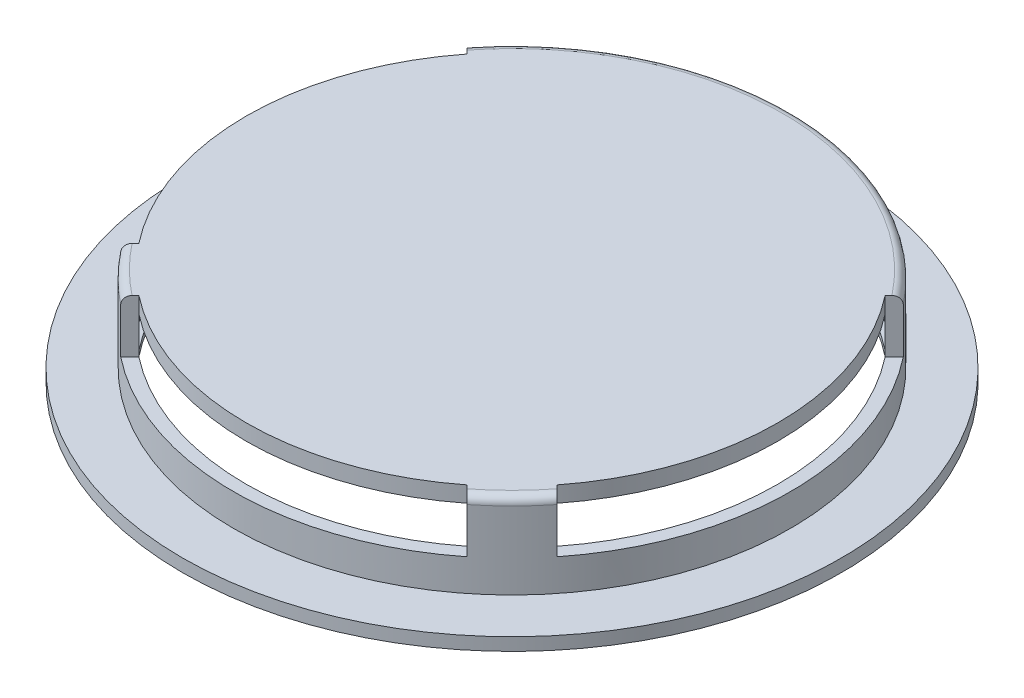
ISO-10303-21;
HEADER;
FILE_DESCRIPTION(('STEP AP214'),'2;1');
FILE_NAME('part.step','',(''),(''),'','','');
FILE_SCHEMA(('AUTOMOTIVE_DESIGN { 1 0 10303 214 1 1 1 1 }'));
ENDSEC;
DATA;
#1=APPLICATION_CONTEXT('core data for automotive mechanical design processes');
#2=APPLICATION_PROTOCOL_DEFINITION('international standard','automotive_design',2000,#1);
#3=PRODUCT_CONTEXT('',#1,'mechanical');
#4=PRODUCT('Part','Part','',(#3));
#5=PRODUCT_RELATED_PRODUCT_CATEGORY('part','',(#4));
#6=PRODUCT_DEFINITION_FORMATION('','',#4);
#7=PRODUCT_DEFINITION_CONTEXT('part definition',#1,'design');
#8=PRODUCT_DEFINITION('design','',#6,#7);
#9=PRODUCT_DEFINITION_SHAPE('','',#8);
#10=(LENGTH_UNIT() NAMED_UNIT(*) SI_UNIT(.MILLI.,.METRE.));
#11=(NAMED_UNIT(*) PLANE_ANGLE_UNIT() SI_UNIT($,.RADIAN.));
#12=(NAMED_UNIT(*) SI_UNIT($,.STERADIAN.) SOLID_ANGLE_UNIT());
#13=UNCERTAINTY_MEASURE_WITH_UNIT(LENGTH_MEASURE(1.E-05),#10,'distance_accuracy_value','');
#14=(GEOMETRIC_REPRESENTATION_CONTEXT(3) GLOBAL_UNCERTAINTY_ASSIGNED_CONTEXT((#13)) GLOBAL_UNIT_ASSIGNED_CONTEXT((#10,
#11,#12)) REPRESENTATION_CONTEXT('',''));
#15=CARTESIAN_POINT('',(0.,0.,0.));
#16=DIRECTION('',(0.,0.,1.));
#17=DIRECTION('',(1.,0.,0.));
#18=AXIS2_PLACEMENT_3D('',#15,#16,#17);
#19=CARTESIAN_POINT('',(0.,1.2,0.));
#20=DIRECTION('',(0.,-1.,0.));
#21=DIRECTION('',(0.,0.,-1.));
#22=AXIS2_PLACEMENT_3D('',#19,#20,#21);
#23=CYLINDRICAL_SURFACE('',#22,25.);
#24=DIRECTION('',(0.,1.,0.));
#25=VECTOR('',#24,1.);
#26=CARTESIAN_POINT('',(-19.6712491183439,4.2,-15.4286084312246));
#27=LINE('',#26,#25);
#28=CARTESIAN_POINT('',(-19.6712491183439,4.2,-15.4286084312246));
#29=VERTEX_POINT('',#28);
#30=CARTESIAN_POINT('',(-19.6712491183439,7.7,-15.4286084312246));
#31=VERTEX_POINT('',#30);
#32=EDGE_CURVE('E666',#29,#31,#27,.T.);
#33=ORIENTED_EDGE('',*,*,#32,.F.);
#34=CARTESIAN_POINT('',(0.,4.2,0.));
#35=DIRECTION('',(0.,-1.,0.));
#36=DIRECTION('',(0.,0.,1.));
#37=AXIS2_PLACEMENT_3D('',#34,#35,#36);
#38=CIRCLE('',#37,25.);
#39=CARTESIAN_POINT('',(-19.6712491183439,4.2,15.4286084312246));
#40=VERTEX_POINT('',#39);
#41=EDGE_CURVE('E176',#40,#29,#38,.T.);
#42=ORIENTED_EDGE('',*,*,#41,.F.);
#43=DIRECTION('',(0.,1.,0.));
#44=VECTOR('',#43,1.);
#45=CARTESIAN_POINT('',(-19.6712491183439,4.2,15.4286084312246));
#46=LINE('',#45,#44);
#47=CARTESIAN_POINT('',(-19.6712491183439,7.7,15.4286084312246));
#48=VERTEX_POINT('',#47);
#49=EDGE_CURVE('E173',#40,#48,#46,.T.);
#50=ORIENTED_EDGE('',*,*,#49,.T.);
#51=CARTESIAN_POINT('',(0.,7.7,0.));
#52=DIRECTION('',(0.,1.,0.));
#53=DIRECTION('',(0.,0.,1.));
#54=AXIS2_PLACEMENT_3D('',#51,#52,#53);
#55=CIRCLE('',#54,25.);
#56=CARTESIAN_POINT('',(-15.4286084312246,7.7,19.6712491183439));
#57=VERTEX_POINT('',#56);
#58=EDGE_CURVE('E269',#48,#57,#55,.T.);
#59=ORIENTED_EDGE('',*,*,#58,.T.);
#60=DIRECTION('',(0.,1.,0.));
#61=VECTOR('',#60,1.);
#62=CARTESIAN_POINT('',(-15.4286084312246,4.2,19.6712491183439));
#63=LINE('',#62,#61);
#64=CARTESIAN_POINT('',(-15.4286084312246,4.2,19.6712491183439));
#65=VERTEX_POINT('',#64);
#66=EDGE_CURVE('E250',#65,#57,#63,.T.);
#67=ORIENTED_EDGE('',*,*,#66,.F.);
#68=CARTESIAN_POINT('',(0.,4.2,0.));
#69=DIRECTION('',(0.,-1.,0.));
#70=DIRECTION('',(0.,0.,1.));
#71=AXIS2_PLACEMENT_3D('',#68,#69,#70);
#72=CIRCLE('',#71,25.);
#73=CARTESIAN_POINT('',(15.4286084312246,4.2,19.6712491183439));
#74=VERTEX_POINT('',#73);
#75=EDGE_CURVE('E236',#74,#65,#72,.T.);
#76=ORIENTED_EDGE('',*,*,#75,.F.);
#77=DIRECTION('',(0.,1.,0.));
#78=VECTOR('',#77,1.);
#79=CARTESIAN_POINT('',(15.4286084312246,4.2,19.6712491183439));
#80=LINE('',#79,#78);
#81=CARTESIAN_POINT('',(15.4286084312246,7.7,19.6712491183439));
#82=VERTEX_POINT('',#81);
#83=EDGE_CURVE('E253',#74,#82,#80,.T.);
#84=ORIENTED_EDGE('',*,*,#83,.T.);
#85=CARTESIAN_POINT('',(19.6712491183439,7.7,15.4286084312246));
#86=VERTEX_POINT('',#85);
#87=EDGE_CURVE('E270',#82,#86,#55,.T.);
#88=ORIENTED_EDGE('',*,*,#87,.T.);
#89=DIRECTION('',(0.,1.,0.));
#90=VECTOR('',#89,1.);
#91=CARTESIAN_POINT('',(19.6712491183439,4.2,15.4286084312246));
#92=LINE('',#91,#90);
#93=CARTESIAN_POINT('',(19.6712491183439,4.2,15.4286084312246));
#94=VERTEX_POINT('',#93);
#95=EDGE_CURVE('E220',#94,#86,#92,.T.);
#96=ORIENTED_EDGE('',*,*,#95,.F.);
#97=CARTESIAN_POINT('',(0.,4.2,0.));
#98=DIRECTION('',(0.,-1.,0.));
#99=DIRECTION('',(0.,0.,1.));
#100=AXIS2_PLACEMENT_3D('',#97,#98,#99);
#101=CIRCLE('',#100,25.);
#102=CARTESIAN_POINT('',(19.6712491183439,4.2,-15.4286084312246));
#103=VERTEX_POINT('',#102);
#104=EDGE_CURVE('E203',#103,#94,#101,.T.);
#105=ORIENTED_EDGE('',*,*,#104,.F.);
#106=DIRECTION('',(0.,1.,0.));
#107=VECTOR('',#106,1.);
#108=CARTESIAN_POINT('',(19.6712491183439,4.2,-15.4286084312246));
#109=LINE('',#108,#107);
#110=CARTESIAN_POINT('',(19.6712491183439,7.7,-15.4286084312246));
#111=VERTEX_POINT('',#110);
#112=EDGE_CURVE('E223',#103,#111,#109,.T.);
#113=ORIENTED_EDGE('',*,*,#112,.T.);
#114=EDGE_CURVE('E274',#111,#31,#55,.T.);
#115=ORIENTED_EDGE('',*,*,#114,.T.);
#116=EDGE_LOOP('',(#33,#42,#50,#59,#67,#76,#84,#88,#96,#105,#113,#115));
#117=FACE_BOUND('',#116,.T.);
#118=CARTESIAN_POINT('',(0.,3.5,0.));
#119=DIRECTION('',(0.,-1.,0.));
#120=DIRECTION('',(0.,0.,-1.));
#121=AXIS2_PLACEMENT_3D('',#118,#119,#120);
#122=CIRCLE('',#121,25.);
#123=CARTESIAN_POINT('',(0.,3.5,-25.));
#124=VERTEX_POINT('',#123);
#125=EDGE_CURVE('E697',#124,#124,#122,.T.);
#126=ORIENTED_EDGE('',*,*,#125,.T.);
#127=EDGE_LOOP('',(#126));
#128=FACE_BOUND('',#127,.T.);
#129=ADVANCED_FACE('F40',(#117,#128),#23,.F.);
#130=CARTESIAN_POINT('',(0.,1.2,0.));
#131=DIRECTION('',(0.,1.,0.));
#132=DIRECTION('',(0.,0.,1.));
#133=AXIS2_PLACEMENT_3D('',#130,#131,#132);
#134=PLANE('',#133);
#135=CARTESIAN_POINT('',(0.,1.2,0.));
#136=DIRECTION('',(0.,1.,0.));
#137=DIRECTION('',(0.,0.,1.));
#138=AXIS2_PLACEMENT_3D('',#135,#136,#137);
#139=CIRCLE('',#138,31.);
#140=CARTESIAN_POINT('',(0.,1.2,31.));
#141=VERTEX_POINT('',#140);
#142=EDGE_CURVE('E281',#141,#141,#139,.T.);
#143=ORIENTED_EDGE('',*,*,#142,.T.);
#144=EDGE_LOOP('',(#143));
#145=FACE_BOUND('',#144,.T.);
#146=CARTESIAN_POINT('',(0.,1.2,0.));
#147=DIRECTION('',(0.,1.,0.));
#148=DIRECTION('',(0.,0.,1.));
#149=AXIS2_PLACEMENT_3D('',#146,#147,#148);
#150=CIRCLE('',#149,26.2);
#151=CARTESIAN_POINT('',(0.,1.2,26.2));
#152=VERTEX_POINT('',#151);
#153=EDGE_CURVE('E273',#152,#152,#150,.T.);
#154=ORIENTED_EDGE('',*,*,#153,.F.);
#155=EDGE_LOOP('',(#154));
#156=FACE_BOUND('',#155,.T.);
#157=ADVANCED_FACE('F362',(#145,#156),#134,.T.);
#158=CARTESIAN_POINT('',(0.,0.,0.));
#159=DIRECTION('',(0.,1.,0.));
#160=DIRECTION('',(0.,0.,1.));
#161=AXIS2_PLACEMENT_3D('',#158,#159,#160);
#162=PLANE('',#161);
#163=CARTESIAN_POINT('',(0.,0.,0.));
#164=DIRECTION('',(0.,1.,0.));
#165=DIRECTION('',(0.,0.,1.));
#166=AXIS2_PLACEMENT_3D('',#163,#164,#165);
#167=CIRCLE('',#166,31.);
#168=CARTESIAN_POINT('',(0.,0.,31.));
#169=VERTEX_POINT('',#168);
#170=EDGE_CURVE('E280',#169,#169,#167,.T.);
#171=ORIENTED_EDGE('',*,*,#170,.F.);
#172=EDGE_LOOP('',(#171));
#173=FACE_BOUND('',#172,.T.);
#174=CARTESIAN_POINT('',(0.,0.,0.));
#175=DIRECTION('',(0.,1.,0.));
#176=DIRECTION('',(0.,0.,1.));
#177=AXIS2_PLACEMENT_3D('',#174,#175,#176);
#178=CIRCLE('',#177,25.);
#179=CARTESIAN_POINT('',(0.,0.,25.));
#180=VERTEX_POINT('',#179);
#181=EDGE_CURVE('E277',#180,#180,#178,.T.);
#182=ORIENTED_EDGE('',*,*,#181,.T.);
#183=EDGE_LOOP('',(#182));
#184=FACE_BOUND('',#183,.T.);
#185=ADVANCED_FACE('F369',(#173,#184),#162,.F.);
#186=CARTESIAN_POINT('',(0.,1.2,0.));
#187=DIRECTION('',(0.,-1.,0.));
#188=DIRECTION('',(0.,0.,-1.));
#189=AXIS2_PLACEMENT_3D('',#186,#187,#188);
#190=CYLINDRICAL_SURFACE('',#189,31.);
#191=ORIENTED_EDGE('',*,*,#142,.F.);
#192=EDGE_LOOP('',(#191));
#193=FACE_BOUND('',#192,.T.);
#194=ORIENTED_EDGE('',*,*,#170,.T.);
#195=EDGE_LOOP('',(#194));
#196=FACE_BOUND('',#195,.T.);
#197=ADVANCED_FACE('F376',(#193,#196),#190,.T.);
#198=CARTESIAN_POINT('',(0.,0.5,0.));
#199=DIRECTION('',(0.,-1.,0.));
#200=DIRECTION('',(0.,0.,-1.));
#201=AXIS2_PLACEMENT_3D('',#198,#199,#200);
#202=CIRCLE('',#201,25.);
#203=CARTESIAN_POINT('',(0.,0.5,-25.));
#204=VERTEX_POINT('',#203);
#205=EDGE_CURVE('E388',#204,#204,#202,.T.);
#206=ORIENTED_EDGE('',*,*,#205,.F.);
#207=EDGE_LOOP('',(#206));
#208=FACE_BOUND('',#207,.T.);
#209=ORIENTED_EDGE('',*,*,#181,.F.);
#210=EDGE_LOOP('',(#209));
#211=FACE_BOUND('',#210,.T.);
#212=ADVANCED_FACE('F365',(#208,#211),#23,.F.);
#213=CARTESIAN_POINT('',(0.,7.7,0.));
#214=DIRECTION('',(0.,-1.,0.));
#215=DIRECTION('',(0.,0.,-1.));
#216=AXIS2_PLACEMENT_3D('',#213,#214,#215);
#217=CYLINDRICAL_SURFACE('',#216,26.2);
#218=ORIENTED_EDGE('',*,*,#153,.T.);
#219=EDGE_LOOP('',(#218));
#220=FACE_BOUND('',#219,.T.);
#221=DIRECTION('',(0.,1.,0.));
#222=VECTOR('',#221,1.);
#223=CARTESIAN_POINT('',(20.5256676560834,4.2,16.2830269689641));
#224=LINE('',#223,#222);
#225=CARTESIAN_POINT('',(20.5256676560834,4.2,16.2830269689641));
#226=VERTEX_POINT('',#225);
#227=CARTESIAN_POINT('',(20.5256676560834,8.45,16.2830269689641));
#228=VERTEX_POINT('',#227);
#229=EDGE_CURVE('E217',#226,#228,#224,.T.);
#230=ORIENTED_EDGE('',*,*,#229,.T.);
#231=CARTESIAN_POINT('',(0.,8.45,0.));
#232=DIRECTION('',(0.,1.,0.));
#233=DIRECTION('',(0.,0.,1.));
#234=AXIS2_PLACEMENT_3D('',#231,#232,#233);
#235=CIRCLE('',#234,26.2);
#236=CARTESIAN_POINT('',(16.2830269689642,8.45,20.5256676560834));
#237=VERTEX_POINT('',#236);
#238=EDGE_CURVE('E636',#228,#237,#235,.F.);
#239=ORIENTED_EDGE('',*,*,#238,.T.);
#240=DIRECTION('',(0.,1.,0.));
#241=VECTOR('',#240,1.);
#242=CARTESIAN_POINT('',(16.2830269689642,4.2,20.5256676560834));
#243=LINE('',#242,#241);
#244=CARTESIAN_POINT('',(16.2830269689642,4.2,20.5256676560834));
#245=VERTEX_POINT('',#244);
#246=EDGE_CURVE('E241',#245,#237,#243,.T.);
#247=ORIENTED_EDGE('',*,*,#246,.F.);
#248=CARTESIAN_POINT('',(0.,4.2,0.));
#249=DIRECTION('',(0.,1.,0.));
#250=DIRECTION('',(0.,0.,1.));
#251=AXIS2_PLACEMENT_3D('',#248,#249,#250);
#252=CIRCLE('',#251,26.2);
#253=CARTESIAN_POINT('',(-16.2830269689641,4.2,20.5256676560834));
#254=VERTEX_POINT('',#253);
#255=EDGE_CURVE('E229',#254,#245,#252,.T.);
#256=ORIENTED_EDGE('',*,*,#255,.F.);
#257=DIRECTION('',(0.,1.,0.));
#258=VECTOR('',#257,1.);
#259=CARTESIAN_POINT('',(-16.2830269689641,4.2,20.5256676560834));
#260=LINE('',#259,#258);
#261=CARTESIAN_POINT('',(-16.2830269689641,8.45,20.5256676560834));
#262=VERTEX_POINT('',#261);
#263=EDGE_CURVE('E212',#254,#262,#260,.T.);
#264=ORIENTED_EDGE('',*,*,#263,.T.);
#265=CARTESIAN_POINT('',(0.,8.45,0.));
#266=DIRECTION('',(0.,1.,0.));
#267=DIRECTION('',(0.,0.,1.));
#268=AXIS2_PLACEMENT_3D('',#265,#266,#267);
#269=CIRCLE('',#268,26.2);
#270=CARTESIAN_POINT('',(-20.5256676560834,8.45,16.2830269689641));
#271=VERTEX_POINT('',#270);
#272=EDGE_CURVE('E56',#262,#271,#269,.F.);
#273=ORIENTED_EDGE('',*,*,#272,.T.);
#274=DIRECTION('',(0.,1.,0.));
#275=VECTOR('',#274,1.);
#276=CARTESIAN_POINT('',(-20.5256676560834,4.2,16.2830269689641));
#277=LINE('',#276,#275);
#278=CARTESIAN_POINT('',(-20.5256676560834,4.2,16.2830269689641));
#279=VERTEX_POINT('',#278);
#280=EDGE_CURVE('E169',#279,#271,#277,.T.);
#281=ORIENTED_EDGE('',*,*,#280,.F.);
#282=CARTESIAN_POINT('',(0.,4.2,0.));
#283=DIRECTION('',(0.,1.,0.));
#284=DIRECTION('',(0.,0.,1.));
#285=AXIS2_PLACEMENT_3D('',#282,#283,#284);
#286=CIRCLE('',#285,26.2);
#287=CARTESIAN_POINT('',(-20.5256676560834,4.2,-16.2830269689641));
#288=VERTEX_POINT('',#287);
#289=EDGE_CURVE('E177',#288,#279,#286,.T.);
#290=ORIENTED_EDGE('',*,*,#289,.F.);
#291=DIRECTION('',(0.,1.,0.));
#292=VECTOR('',#291,1.);
#293=CARTESIAN_POINT('',(-20.5256676560834,4.2,-16.2830269689641));
#294=LINE('',#293,#292);
#295=CARTESIAN_POINT('',(-20.5256676560834,8.45,-16.2830269689641));
#296=VERTEX_POINT('',#295);
#297=EDGE_CURVE('E263',#288,#296,#294,.T.);
#298=ORIENTED_EDGE('',*,*,#297,.T.);
#299=CARTESIAN_POINT('',(0.,8.45,0.));
#300=DIRECTION('',(0.,1.,0.));
#301=DIRECTION('',(0.,0.,1.));
#302=AXIS2_PLACEMENT_3D('',#299,#300,#301);
#303=CIRCLE('',#302,26.2);
#304=CARTESIAN_POINT('',(20.5256676560834,8.45,-16.2830269689641));
#305=VERTEX_POINT('',#304);
#306=EDGE_CURVE('E303',#296,#305,#303,.F.);
#307=ORIENTED_EDGE('',*,*,#306,.T.);
#308=DIRECTION('',(0.,1.,0.));
#309=VECTOR('',#308,1.);
#310=CARTESIAN_POINT('',(20.5256676560834,4.2,-16.2830269689641));
#311=LINE('',#310,#309);
#312=CARTESIAN_POINT('',(20.5256676560834,4.2,-16.2830269689641));
#313=VERTEX_POINT('',#312);
#314=EDGE_CURVE('E208',#313,#305,#311,.T.);
#315=ORIENTED_EDGE('',*,*,#314,.F.);
#316=CARTESIAN_POINT('',(0.,4.2,0.));
#317=DIRECTION('',(0.,1.,0.));
#318=DIRECTION('',(0.,0.,1.));
#319=AXIS2_PLACEMENT_3D('',#316,#317,#318);
#320=CIRCLE('',#319,26.2);
#321=EDGE_CURVE('E196',#226,#313,#320,.T.);
#322=ORIENTED_EDGE('',*,*,#321,.F.);
#323=EDGE_LOOP('',(#230,#239,#247,#256,#264,#273,#281,#290,#298,#307,#315,#322));
#324=FACE_BOUND('',#323,.T.);
#325=ADVANCED_FACE('F188',(#220,#324),#217,.T.);
#326=CARTESIAN_POINT('',(0.,7.7,0.));
#327=DIRECTION('',(0.,1.,0.));
#328=DIRECTION('',(0.,0.,1.));
#329=AXIS2_PLACEMENT_3D('',#326,#327,#328);
#330=PLANE('',#329);
#331=CARTESIAN_POINT('',(0.,7.7,0.));
#332=DIRECTION('',(0.,1.,0.));
#333=DIRECTION('',(0.,0.,1.));
#334=AXIS2_PLACEMENT_3D('',#331,#332,#333);
#335=CIRCLE('',#334,3.5);
#336=CARTESIAN_POINT('',(0.,7.7,3.5));
#337=VERTEX_POINT('',#336);
#338=EDGE_CURVE('E11',#337,#337,#335,.F.);
#339=ORIENTED_EDGE('',*,*,#338,.F.);
#340=EDGE_LOOP('',(#339));
#341=FACE_BOUND('',#340,.T.);
#342=ORIENTED_EDGE('',*,*,#87,.F.);
#343=CARTESIAN_POINT('',(0.,7.7,0.));
#344=DIRECTION('',(0.,1.,0.));
#345=DIRECTION('',(0.,0.,1.));
#346=AXIS2_PLACEMENT_3D('',#343,#344,#345);
#347=CIRCLE('',#346,25.);
#348=EDGE_CURVE('E259',#82,#57,#347,.F.);
#349=ORIENTED_EDGE('',*,*,#348,.T.);
#350=ORIENTED_EDGE('',*,*,#58,.F.);
#351=CARTESIAN_POINT('',(0.,7.7,0.));
#352=DIRECTION('',(0.,1.,0.));
#353=DIRECTION('',(0.,0.,1.));
#354=AXIS2_PLACEMENT_3D('',#351,#352,#353);
#355=CIRCLE('',#354,25.);
#356=EDGE_CURVE('E266',#48,#31,#355,.F.);
#357=ORIENTED_EDGE('',*,*,#356,.T.);
#358=ORIENTED_EDGE('',*,*,#114,.F.);
#359=CARTESIAN_POINT('',(0.,7.7,0.));
#360=DIRECTION('',(0.,1.,0.));
#361=DIRECTION('',(0.,0.,1.));
#362=AXIS2_PLACEMENT_3D('',#359,#360,#361);
#363=CIRCLE('',#362,25.);
#364=EDGE_CURVE('E262',#111,#86,#363,.F.);
#365=ORIENTED_EDGE('',*,*,#364,.T.);
#366=EDGE_LOOP('',(#342,#349,#350,#357,#358,#365));
#367=FACE_BOUND('',#366,.T.);
#368=ADVANCED_FACE('F382',(#341,#367),#330,.F.);
#369=CARTESIAN_POINT('',(0.,9.2,0.));
#370=DIRECTION('',(0.,1.,0.));
#371=DIRECTION('',(0.,0.,1.));
#372=AXIS2_PLACEMENT_3D('',#369,#370,#371);
#373=PLANE('',#372);
#374=DIRECTION('',(-0.707106781186549,0.,-0.707106781186546));
#375=VECTOR('',#374,1.);
#376=CARTESIAN_POINT('',(16.2830269689642,9.2,20.5256676560834));
#377=LINE('',#376,#375);
#378=CARTESIAN_POINT('',(15.749081162842,9.2,19.9917218499612));
#379=VERTEX_POINT('',#378);
#380=CARTESIAN_POINT('',(15.4286084312246,9.2,19.6712491183439));
#381=VERTEX_POINT('',#380);
#382=EDGE_CURVE('E242',#379,#381,#377,.T.);
#383=ORIENTED_EDGE('',*,*,#382,.F.);
#384=CARTESIAN_POINT('',(0.,9.2,0.));
#385=DIRECTION('',(0.,1.,0.));
#386=DIRECTION('',(0.,0.,1.));
#387=AXIS2_PLACEMENT_3D('',#384,#385,#386);
#388=CIRCLE('',#387,25.45);
#389=CARTESIAN_POINT('',(19.9917218499613,9.2,15.7490811628419));
#390=VERTEX_POINT('',#389);
#391=EDGE_CURVE('E292',#379,#390,#388,.T.);
#392=ORIENTED_EDGE('',*,*,#391,.T.);
#393=DIRECTION('',(0.707106781186548,0.,0.707106781186547));
#394=VECTOR('',#393,1.);
#395=CARTESIAN_POINT('',(20.5256676560834,9.2,16.2830269689641));
#396=LINE('',#395,#394);
#397=CARTESIAN_POINT('',(19.6712491183439,9.2,15.4286084312246));
#398=VERTEX_POINT('',#397);
#399=EDGE_CURVE('E200',#398,#390,#396,.T.);
#400=ORIENTED_EDGE('',*,*,#399,.F.);
#401=CARTESIAN_POINT('',(0.,9.2,0.));
#402=DIRECTION('',(0.,-1.,0.));
#403=DIRECTION('',(0.,0.,1.));
#404=AXIS2_PLACEMENT_3D('',#401,#402,#403);
#405=CIRCLE('',#404,25.);
#406=CARTESIAN_POINT('',(19.6712491183439,9.2,-15.4286084312246));
#407=VERTEX_POINT('',#406);
#408=EDGE_CURVE('E211',#407,#398,#405,.T.);
#409=ORIENTED_EDGE('',*,*,#408,.F.);
#410=DIRECTION('',(-0.707106781186549,0.,0.707106781186546));
#411=VECTOR('',#410,1.);
#412=CARTESIAN_POINT('',(20.5256676560834,9.2,-16.2830269689641));
#413=LINE('',#412,#411);
#414=CARTESIAN_POINT('',(19.9917218499613,9.2,-15.7490811628419));
#415=VERTEX_POINT('',#414);
#416=EDGE_CURVE('E209',#415,#407,#413,.T.);
#417=ORIENTED_EDGE('',*,*,#416,.F.);
#418=CARTESIAN_POINT('',(0.,9.2,0.));
#419=DIRECTION('',(0.,1.,0.));
#420=DIRECTION('',(0.,0.,1.));
#421=AXIS2_PLACEMENT_3D('',#418,#419,#420);
#422=CIRCLE('',#421,25.45);
#423=CARTESIAN_POINT('',(-19.9917218499613,9.2,-15.7490811628419));
#424=VERTEX_POINT('',#423);
#425=EDGE_CURVE('E284',#415,#424,#422,.T.);
#426=ORIENTED_EDGE('',*,*,#425,.T.);
#427=DIRECTION('',(-0.707106781186549,0.,-0.707106781186546));
#428=VECTOR('',#427,1.);
#429=CARTESIAN_POINT('',(-19.6712491183439,9.2,-15.4286084312246));
#430=LINE('',#429,#428);
#431=CARTESIAN_POINT('',(-19.6712491183439,9.2,-15.4286084312246));
#432=VERTEX_POINT('',#431);
#433=EDGE_CURVE('E185',#432,#424,#430,.T.);
#434=ORIENTED_EDGE('',*,*,#433,.F.);
#435=CARTESIAN_POINT('',(0.,9.2,0.));
#436=DIRECTION('',(0.,-1.,0.));
#437=DIRECTION('',(0.,0.,1.));
#438=AXIS2_PLACEMENT_3D('',#435,#436,#437);
#439=CIRCLE('',#438,25.);
#440=CARTESIAN_POINT('',(-19.6712491183439,9.2,15.4286084312246));
#441=VERTEX_POINT('',#440);
#442=EDGE_CURVE('E651',#441,#432,#439,.T.);
#443=ORIENTED_EDGE('',*,*,#442,.F.);
#444=DIRECTION('',(0.707106781186548,0.,-0.707106781186548));
#445=VECTOR('',#444,1.);
#446=CARTESIAN_POINT('',(-19.6712491183439,9.2,15.4286084312246));
#447=LINE('',#446,#445);
#448=CARTESIAN_POINT('',(-19.9917218499612,9.2,15.7490811628419));
#449=VERTEX_POINT('',#448);
#450=EDGE_CURVE('E219',#449,#441,#447,.T.);
#451=ORIENTED_EDGE('',*,*,#450,.F.);
#452=CARTESIAN_POINT('',(0.,9.2,0.));
#453=DIRECTION('',(0.,1.,0.));
#454=DIRECTION('',(0.,0.,1.));
#455=AXIS2_PLACEMENT_3D('',#452,#453,#454);
#456=CIRCLE('',#455,25.45);
#457=CARTESIAN_POINT('',(-15.749081162842,9.2,19.9917218499612));
#458=VERTEX_POINT('',#457);
#459=EDGE_CURVE('E289',#449,#458,#456,.T.);
#460=ORIENTED_EDGE('',*,*,#459,.T.);
#461=DIRECTION('',(-0.707106781186549,0.,0.707106781186546));
#462=VECTOR('',#461,1.);
#463=CARTESIAN_POINT('',(-15.4286084312246,9.2,19.6712491183439));
#464=LINE('',#463,#462);
#465=CARTESIAN_POINT('',(-15.4286084312246,9.2,19.6712491183439));
#466=VERTEX_POINT('',#465);
#467=EDGE_CURVE('E233',#466,#458,#464,.T.);
#468=ORIENTED_EDGE('',*,*,#467,.F.);
#469=CARTESIAN_POINT('',(0.,9.2,0.));
#470=DIRECTION('',(0.,-1.,0.));
#471=DIRECTION('',(0.,0.,1.));
#472=AXIS2_PLACEMENT_3D('',#469,#470,#471);
#473=CIRCLE('',#472,25.);
#474=EDGE_CURVE('E244',#381,#466,#473,.T.);
#475=ORIENTED_EDGE('',*,*,#474,.F.);
#476=EDGE_LOOP('',(#383,#392,#400,#409,#417,#426,#434,#443,#451,#460,#468,#475));
#477=FACE_BOUND('',#476,.T.);
#478=ADVANCED_FACE('F421',(#477),#373,.T.);
#479=CARTESIAN_POINT('',(0.,4.2,0.));
#480=DIRECTION('',(0.,1.,0.));
#481=DIRECTION('',(0.,0.,1.));
#482=AXIS2_PLACEMENT_3D('',#479,#480,#481);
#483=CYLINDRICAL_SURFACE('',#482,25.);
#484=EDGE_CURVE('E256',#82,#381,#80,.T.);
#485=ORIENTED_EDGE('',*,*,#484,.T.);
#486=ORIENTED_EDGE('',*,*,#474,.T.);
#487=EDGE_CURVE('E252',#57,#466,#63,.T.);
#488=ORIENTED_EDGE('',*,*,#487,.F.);
#489=ORIENTED_EDGE('',*,*,#348,.F.);
#490=EDGE_LOOP('',(#485,#486,#488,#489));
#491=FACE_BOUND('',#490,.T.);
#492=ADVANCED_FACE('F415',(#491),#483,.T.);
#493=CARTESIAN_POINT('',(-15.4286084312246,4.2,19.6712491183439));
#494=DIRECTION('',(-0.707106781186546,0.,-0.707106781186549));
#495=DIRECTION('',(-0.707106781186549,0.,0.707106781186546));
#496=AXIS2_PLACEMENT_3D('',#493,#494,#495);
#497=PLANE('',#496);
#498=ORIENTED_EDGE('',*,*,#467,.T.);
#499=CARTESIAN_POINT('',(-15.749081162842,9.2,19.9917218499612));
#500=CARTESIAN_POINT('',(-15.7792718380052,9.20003490023137,20.0219125251244));
#501=CARTESIAN_POINT('',(-15.8094563153209,9.19640678366061,20.0520970024402));
#502=CARTESIAN_POINT('',(-15.8689569831165,9.18207813282909,20.1115976702357));
#503=CARTESIAN_POINT('',(-15.8982736631832,9.17138166896901,20.1409143503024));
#504=CARTESIAN_POINT('',(-15.955235381937,9.14316154286892,20.1978760690562));
#505=CARTESIAN_POINT('',(-15.9828794800184,9.1256340795748,20.2255201671377));
#506=CARTESIAN_POINT('',(-16.0356793760513,9.08424927202193,20.2783200631705));
#507=CARTESIAN_POINT('',(-16.0608357608139,9.06039342543879,20.3034764479331));
#508=CARTESIAN_POINT('',(-16.1078585470878,9.00710036614463,20.350499234207));
#509=CARTESIAN_POINT('',(-16.1297355546292,8.97768187405825,20.3723762417484));
#510=CARTESIAN_POINT('',(-16.1696636410538,8.91403080582596,20.4123043281731));
#511=CARTESIAN_POINT('',(-16.1877140192906,8.87979734997736,20.4303547064098));
#512=CARTESIAN_POINT('',(-16.2193486891584,8.80772809959604,20.4619893762777));
#513=CARTESIAN_POINT('',(-16.2329602557818,8.76991622065788,20.4756009429011));
#514=CARTESIAN_POINT('',(-16.2554632829001,8.69159291585803,20.4981039700193));
#515=CARTESIAN_POINT('',(-16.2643579567352,8.65108334900163,20.5069986438545));
#516=CARTESIAN_POINT('',(-16.2748398378859,8.58358276583621,20.5174805250051));
#517=CARTESIAN_POINT('',(-16.2779081939649,8.55703337609625,20.5205488810841));
#518=CARTESIAN_POINT('',(-16.2820013805047,8.50365988688579,20.524642067624));
#519=CARTESIAN_POINT('',(-16.2830291255621,8.47683623430488,20.5256698126813));
#520=CARTESIAN_POINT('',(-16.2830269689641,8.45,20.5256676560834));
#521=B_SPLINE_CURVE_WITH_KNOTS('',3,(#499,#500,#501,#502,#503,#504,#505,#506,#507,#508,#509,
#510,#511,#512,#513,#514,#515,#516,#517,#518,#519,#520),.UNSPECIFIED.,.F.,.F.,(4,2,2,2,2,2,2,2,
2,2,4),(0.,0.12792209380038,0.255770586102816,0.383690320464706,0.511579808299925,
0.639046317613867,0.766536145616737,0.893227146374988,1.01983172880891,1.10039172125669,
1.18083656718087),.UNSPECIFIED.);
#522=EDGE_CURVE('E64',#458,#262,#521,.T.);
#523=ORIENTED_EDGE('',*,*,#522,.T.);
#524=ORIENTED_EDGE('',*,*,#263,.F.);
#525=DIRECTION('',(-0.707106781186549,0.,0.707106781186546));
#526=VECTOR('',#525,1.);
#527=CARTESIAN_POINT('',(-15.4286084312246,4.2,19.6712491183439));
#528=LINE('',#527,#526);
#529=EDGE_CURVE('E238',#65,#254,#528,.T.);
#530=ORIENTED_EDGE('',*,*,#529,.F.);
#531=ORIENTED_EDGE('',*,*,#66,.T.);
#532=ORIENTED_EDGE('',*,*,#487,.T.);
#533=EDGE_LOOP('',(#498,#523,#524,#530,#531,#532));
#534=FACE_BOUND('',#533,.T.);
#535=ADVANCED_FACE('F420',(#534),#497,.F.);
#536=CARTESIAN_POINT('',(16.2830269689642,4.2,20.5256676560834));
#537=DIRECTION('',(0.707106781186546,0.,-0.707106781186549));
#538=DIRECTION('',(-0.707106781186549,0.,-0.707106781186546));
#539=AXIS2_PLACEMENT_3D('',#536,#537,#538);
#540=PLANE('',#539);
#541=ORIENTED_EDGE('',*,*,#246,.T.);
#542=CARTESIAN_POINT('',(16.2830269689641,8.45,20.5256676560834));
#543=CARTESIAN_POINT('',(16.2830531082391,8.49199103125782,20.5256937953583));
#544=CARTESIAN_POINT('',(16.2805184505327,8.53396975001277,20.5231591376519));
#545=CARTESIAN_POINT('',(16.2705217761169,8.61669692399233,20.5131624632361));
#546=CARTESIAN_POINT('',(16.26306453592,8.65744653181453,20.5057052230392));
#547=CARTESIAN_POINT('',(16.2434121410733,8.73661225663461,20.4860528281925));
#548=CARTESIAN_POINT('',(16.2312150089781,8.77502739196388,20.4738556960973));
#549=CARTESIAN_POINT('',(16.2024495017523,8.8484230886212,20.4450901888715));
#550=CARTESIAN_POINT('',(16.1858816718812,8.88340407762428,20.4285223590004));
#551=CARTESIAN_POINT('',(16.148798112607,8.94905777520394,20.3914387997262));
#552=CARTESIAN_POINT('',(16.1282713122769,8.97971797486696,20.3709119993961));
#553=CARTESIAN_POINT('',(16.0838851567981,9.03577217960659,20.3265258439173));
#554=CARTESIAN_POINT('',(16.0600251160899,9.06116509866655,20.3026658032092));
#555=CARTESIAN_POINT('',(16.009492366328,9.10613043865692,20.2521330534472));
#556=CARTESIAN_POINT('',(15.9828025618587,9.12566439262752,20.2254432489779));
#557=CARTESIAN_POINT('',(15.9274971213409,9.15815385659539,20.1701378084601));
#558=CARTESIAN_POINT('',(15.8988824296429,9.17111256613442,20.1415231167621));
#559=CARTESIAN_POINT('',(15.8499415596878,9.1870551651327,20.092582246807));
#560=CARTESIAN_POINT('',(15.8299092823368,9.1919066767444,20.072549969456));
#561=CARTESIAN_POINT('',(15.7896143452807,9.19837880457077,20.0322550323999));
#562=CARTESIAN_POINT('',(15.7693520535697,9.20000400400263,20.0119927406889));
#563=CARTESIAN_POINT('',(15.749081162842,9.2,19.9917218499612));
#564=B_SPLINE_CURVE_WITH_KNOTS('',3,(#542,#543,#544,#545,#546,#547,#548,#549,#550,#551,#552,
#553,#554,#555,#556,#557,#558,#559,#560,#561,#562,#563),.UNSPECIFIED.,.F.,.F.,(4,2,2,2,2,2,2,2,
2,2,4),(0.,0.125802423439452,0.251482956528448,0.377215978932027,0.502933323124866,
0.629007460624349,0.75510756651724,0.882018317396054,1.00886725359976,1.09492197691826,
1.18085436535206),.UNSPECIFIED.);
#565=EDGE_CURVE('E630',#237,#379,#564,.T.);
#566=ORIENTED_EDGE('',*,*,#565,.T.);
#567=ORIENTED_EDGE('',*,*,#382,.T.);
#568=ORIENTED_EDGE('',*,*,#484,.F.);
#569=ORIENTED_EDGE('',*,*,#83,.F.);
#570=DIRECTION('',(-0.707106781186549,0.,-0.707106781186546));
#571=VECTOR('',#570,1.);
#572=CARTESIAN_POINT('',(16.2830269689642,4.2,20.5256676560834));
#573=LINE('',#572,#571);
#574=EDGE_CURVE('E232',#245,#74,#573,.T.);
#575=ORIENTED_EDGE('',*,*,#574,.F.);
#576=EDGE_LOOP('',(#541,#566,#567,#568,#569,#575));
#577=FACE_BOUND('',#576,.T.);
#578=ADVANCED_FACE('F435',(#577),#540,.F.);
#579=CARTESIAN_POINT('',(0.,4.2,0.));
#580=DIRECTION('',(0.,1.,0.));
#581=DIRECTION('',(0.,0.,1.));
#582=AXIS2_PLACEMENT_3D('',#579,#580,#581);
#583=PLANE('',#582);
#584=ORIENTED_EDGE('',*,*,#255,.T.);
#585=ORIENTED_EDGE('',*,*,#574,.T.);
#586=ORIENTED_EDGE('',*,*,#75,.T.);
#587=ORIENTED_EDGE('',*,*,#529,.T.);
#588=EDGE_LOOP('',(#584,#585,#586,#587));
#589=FACE_BOUND('',#588,.T.);
#590=ADVANCED_FACE('F320',(#589),#583,.T.);
#591=CARTESIAN_POINT('',(0.,4.2,0.));
#592=DIRECTION('',(0.,1.,0.));
#593=DIRECTION('',(0.,0.,1.));
#594=AXIS2_PLACEMENT_3D('',#591,#592,#593);
#595=CYLINDRICAL_SURFACE('',#594,25.);
#596=EDGE_CURVE('E226',#111,#407,#109,.T.);
#597=ORIENTED_EDGE('',*,*,#596,.T.);
#598=ORIENTED_EDGE('',*,*,#408,.T.);
#599=EDGE_CURVE('E222',#86,#398,#92,.T.);
#600=ORIENTED_EDGE('',*,*,#599,.F.);
#601=ORIENTED_EDGE('',*,*,#364,.F.);
#602=EDGE_LOOP('',(#597,#598,#600,#601));
#603=FACE_BOUND('',#602,.T.);
#604=ADVANCED_FACE('F314',(#603),#595,.T.);
#605=CARTESIAN_POINT('',(20.5256676560834,4.2,16.2830269689641));
#606=DIRECTION('',(-0.707106781186547,0.,0.707106781186548));
#607=DIRECTION('',(0.707106781186548,0.,0.707106781186547));
#608=AXIS2_PLACEMENT_3D('',#605,#606,#607);
#609=PLANE('',#608);
#610=ORIENTED_EDGE('',*,*,#399,.T.);
#611=CARTESIAN_POINT('',(19.9917218499613,9.2,15.7490811628419));
#612=CARTESIAN_POINT('',(20.0219125251244,9.20003490023137,15.7792718380051));
#613=CARTESIAN_POINT('',(20.0520970024402,9.19640678366061,15.8094563153209));
#614=CARTESIAN_POINT('',(20.1115976702358,9.18207813282909,15.8689569831164));
#615=CARTESIAN_POINT('',(20.1409143503025,9.17138166896901,15.8982736631831));
#616=CARTESIAN_POINT('',(20.1978760690562,9.14316154286892,15.9552353819369));
#617=CARTESIAN_POINT('',(20.2255201671377,9.1256340795748,15.9828794800184));
#618=CARTESIAN_POINT('',(20.2783200631706,9.08424927202194,16.0356793760512));
#619=CARTESIAN_POINT('',(20.3034764479332,9.06039342543879,16.0608357608138));
#620=CARTESIAN_POINT('',(20.350499234207,9.00710036614464,16.1078585470877));
#621=CARTESIAN_POINT('',(20.3723762417484,8.97768187405826,16.1297355546291));
#622=CARTESIAN_POINT('',(20.4123043281731,8.91403080582597,16.1696636410538));
#623=CARTESIAN_POINT('',(20.4303547064099,8.87979734997736,16.1877140192905));
#624=CARTESIAN_POINT('',(20.4619893762777,8.80772809959604,16.2193486891584));
#625=CARTESIAN_POINT('',(20.4756009429011,8.76991622065788,16.2329602557818));
#626=CARTESIAN_POINT('',(20.4981039700194,8.69159291585803,16.2554632829));
#627=CARTESIAN_POINT('',(20.5069986438545,8.65108334900163,16.2643579567352));
#628=CARTESIAN_POINT('',(20.5174805250051,8.5835827658362,16.2748398378858));
#629=CARTESIAN_POINT('',(20.5205488810842,8.55703337609625,16.2779081939648));
#630=CARTESIAN_POINT('',(20.524642067624,8.50365988688579,16.2820013805047));
#631=CARTESIAN_POINT('',(20.5256698126814,8.47683623430488,16.283029125562));
#632=CARTESIAN_POINT('',(20.5256676560834,8.45,16.2830269689641));
#633=B_SPLINE_CURVE_WITH_KNOTS('',3,(#611,#612,#613,#614,#615,#616,#617,#618,#619,#620,#621,
#622,#623,#624,#625,#626,#627,#628,#629,#630,#631,#632),.UNSPECIFIED.,.F.,.F.,(4,2,2,2,2,2,2,2,
2,2,4),(0.,0.12792209380038,0.255770586102816,0.383690320464705,0.511579808299925,
0.639046317613868,0.766536145616737,0.893227146374991,1.01983172880892,1.1003917212567,
1.18083656718087),.UNSPECIFIED.);
#634=EDGE_CURVE('E295',#390,#228,#633,.T.);
#635=ORIENTED_EDGE('',*,*,#634,.T.);
#636=ORIENTED_EDGE('',*,*,#229,.F.);
#637=DIRECTION('',(0.707106781186548,0.,0.707106781186547));
#638=VECTOR('',#637,1.);
#639=CARTESIAN_POINT('',(20.5256676560834,4.2,16.2830269689641));
#640=LINE('',#639,#638);
#641=EDGE_CURVE('E205',#94,#226,#640,.T.);
#642=ORIENTED_EDGE('',*,*,#641,.F.);
#643=ORIENTED_EDGE('',*,*,#95,.T.);
#644=ORIENTED_EDGE('',*,*,#599,.T.);
#645=EDGE_LOOP('',(#610,#635,#636,#642,#643,#644));
#646=FACE_BOUND('',#645,.T.);
#647=ADVANCED_FACE('F308',(#646),#609,.F.);
#648=CARTESIAN_POINT('',(20.5256676560834,4.2,-16.2830269689641));
#649=DIRECTION('',(-0.707106781186546,0.,-0.707106781186549));
#650=DIRECTION('',(-0.707106781186549,0.,0.707106781186546));
#651=AXIS2_PLACEMENT_3D('',#648,#649,#650);
#652=PLANE('',#651);
#653=ORIENTED_EDGE('',*,*,#314,.T.);
#654=CARTESIAN_POINT('',(20.5256676560834,8.45,-16.2830269689641));
#655=CARTESIAN_POINT('',(20.5256937953583,8.49199103125782,-16.283053108239));
#656=CARTESIAN_POINT('',(20.523159137652,8.53396975001277,-16.2805184505327));
#657=CARTESIAN_POINT('',(20.5131624632362,8.61669692399233,-16.2705217761168));
#658=CARTESIAN_POINT('',(20.5057052230393,8.65744653181453,-16.2630645359199));
#659=CARTESIAN_POINT('',(20.4860528281926,8.73661225663461,-16.2434121410733));
#660=CARTESIAN_POINT('',(20.4738556960973,8.77502739196388,-16.231215008978));
#661=CARTESIAN_POINT('',(20.4450901888715,8.8484230886212,-16.2024495017522));
#662=CARTESIAN_POINT('',(20.4285223590005,8.88340407762429,-16.1858816718812));
#663=CARTESIAN_POINT('',(20.3914387997263,8.94905777520394,-16.1487981126069));
#664=CARTESIAN_POINT('',(20.3709119993962,8.97971797486696,-16.1282713122769));
#665=CARTESIAN_POINT('',(20.3265258439173,9.03577217960659,-16.083885156798));
#666=CARTESIAN_POINT('',(20.3026658032092,9.06116509866655,-16.0600251160899));
#667=CARTESIAN_POINT('',(20.2521330534473,9.10613043865692,-16.0094923663279));
#668=CARTESIAN_POINT('',(20.225443248978,9.12566439262751,-15.9828025618586));
#669=CARTESIAN_POINT('',(20.1701378084601,9.15815385659539,-15.9274971213408));
#670=CARTESIAN_POINT('',(20.1415231167621,9.17111256613442,-15.8988824296428));
#671=CARTESIAN_POINT('',(20.092582246807,9.1870551651327,-15.8499415596877));
#672=CARTESIAN_POINT('',(20.072549969456,9.1919066767444,-15.8299092823367));
#673=CARTESIAN_POINT('',(20.0322550324,9.19837880457077,-15.7896143452807));
#674=CARTESIAN_POINT('',(20.011992740689,9.20000400400262,-15.7693520535697));
#675=CARTESIAN_POINT('',(19.9917218499613,9.2,-15.7490811628419));
#676=B_SPLINE_CURVE_WITH_KNOTS('',3,(#654,#655,#656,#657,#658,#659,#660,#661,#662,#663,#664,
#665,#666,#667,#668,#669,#670,#671,#672,#673,#674,#675),.UNSPECIFIED.,.F.,.F.,(4,2,2,2,2,2,2,2,
2,2,4),(0.,0.125802423439454,0.251482956528449,0.377215978932031,0.502933323124871,
0.629007460624348,0.755107566517241,0.88201831739606,1.00886725359976,1.09492197691825,
1.18085436535206),.UNSPECIFIED.);
#677=EDGE_CURVE('E49',#305,#415,#676,.T.);
#678=ORIENTED_EDGE('',*,*,#677,.T.);
#679=ORIENTED_EDGE('',*,*,#416,.T.);
#680=ORIENTED_EDGE('',*,*,#596,.F.);
#681=ORIENTED_EDGE('',*,*,#112,.F.);
#682=DIRECTION('',(-0.707106781186549,0.,0.707106781186546));
#683=VECTOR('',#682,1.);
#684=CARTESIAN_POINT('',(20.5256676560834,4.2,-16.2830269689641));
#685=LINE('',#684,#683);
#686=EDGE_CURVE('E199',#313,#103,#685,.T.);
#687=ORIENTED_EDGE('',*,*,#686,.F.);
#688=EDGE_LOOP('',(#653,#678,#679,#680,#681,#687));
#689=FACE_BOUND('',#688,.T.);
#690=ADVANCED_FACE('F313',(#689),#652,.F.);
#691=CARTESIAN_POINT('',(0.,4.2,0.));
#692=DIRECTION('',(0.,1.,0.));
#693=DIRECTION('',(0.,0.,1.));
#694=AXIS2_PLACEMENT_3D('',#691,#692,#693);
#695=PLANE('',#694);
#696=ORIENTED_EDGE('',*,*,#321,.T.);
#697=ORIENTED_EDGE('',*,*,#686,.T.);
#698=ORIENTED_EDGE('',*,*,#104,.T.);
#699=ORIENTED_EDGE('',*,*,#641,.T.);
#700=EDGE_LOOP('',(#696,#697,#698,#699));
#701=FACE_BOUND('',#700,.T.);
#702=ADVANCED_FACE('F316',(#701),#695,.T.);
#703=CARTESIAN_POINT('',(0.,4.2,0.));
#704=DIRECTION('',(0.,1.,0.));
#705=DIRECTION('',(0.,0.,1.));
#706=AXIS2_PLACEMENT_3D('',#703,#704,#705);
#707=CYLINDRICAL_SURFACE('',#706,25.);
#708=EDGE_CURVE('E189',#48,#441,#46,.T.);
#709=ORIENTED_EDGE('',*,*,#708,.T.);
#710=ORIENTED_EDGE('',*,*,#442,.T.);
#711=EDGE_CURVE('E662',#31,#432,#27,.T.);
#712=ORIENTED_EDGE('',*,*,#711,.F.);
#713=ORIENTED_EDGE('',*,*,#356,.F.);
#714=EDGE_LOOP('',(#709,#710,#712,#713));
#715=FACE_BOUND('',#714,.T.);
#716=ADVANCED_FACE('F350',(#715),#707,.T.);
#717=CARTESIAN_POINT('',(-19.6712491183439,4.2,-15.4286084312246));
#718=DIRECTION('',(0.707106781186546,0.,-0.707106781186549));
#719=DIRECTION('',(-0.707106781186549,0.,-0.707106781186546));
#720=AXIS2_PLACEMENT_3D('',#717,#718,#719);
#721=PLANE('',#720);
#722=ORIENTED_EDGE('',*,*,#433,.T.);
#723=CARTESIAN_POINT('',(-19.9917218499613,9.2,-15.7490811628419));
#724=CARTESIAN_POINT('',(-20.0219125251244,9.20003490023137,-15.7792718380051));
#725=CARTESIAN_POINT('',(-20.0520970024402,9.19640678366061,-15.8094563153209));
#726=CARTESIAN_POINT('',(-20.1115976702358,9.18207813282909,-15.8689569831164));
#727=CARTESIAN_POINT('',(-20.1409143503025,9.17138166896901,-15.8982736631831));
#728=CARTESIAN_POINT('',(-20.1978760690562,9.14316154286892,-15.9552353819369));
#729=CARTESIAN_POINT('',(-20.2255201671377,9.12563407957479,-15.9828794800184));
#730=CARTESIAN_POINT('',(-20.2783200631706,9.08424927202193,-16.0356793760512));
#731=CARTESIAN_POINT('',(-20.3034764479332,9.06039342543879,-16.0608357608138));
#732=CARTESIAN_POINT('',(-20.350499234207,9.00710036614463,-16.1078585470877));
#733=CARTESIAN_POINT('',(-20.3723762417484,8.97768187405825,-16.1297355546291));
#734=CARTESIAN_POINT('',(-20.4123043281731,8.91403080582596,-16.1696636410538));
#735=CARTESIAN_POINT('',(-20.4303547064099,8.87979734997735,-16.1877140192905));
#736=CARTESIAN_POINT('',(-20.4619893762777,8.80772809959603,-16.2193486891584));
#737=CARTESIAN_POINT('',(-20.4756009429011,8.76991622065787,-16.2329602557818));
#738=CARTESIAN_POINT('',(-20.4981039700194,8.69159291585802,-16.2554632829));
#739=CARTESIAN_POINT('',(-20.5069986438545,8.65108334900162,-16.2643579567352));
#740=CARTESIAN_POINT('',(-20.5174805250052,8.5835827658362,-16.2748398378858));
#741=CARTESIAN_POINT('',(-20.5205488810842,8.55703337609624,-16.2779081939648));
#742=CARTESIAN_POINT('',(-20.524642067624,8.50365988688579,-16.2820013805047));
#743=CARTESIAN_POINT('',(-20.5256698126814,8.47683623430488,-16.283029125562));
#744=CARTESIAN_POINT('',(-20.5256676560834,8.45,-16.2830269689641));
#745=B_SPLINE_CURVE_WITH_KNOTS('',3,(#723,#724,#725,#726,#727,#728,#729,#730,#731,#732,#733,
#734,#735,#736,#737,#738,#739,#740,#741,#742,#743,#744),.UNSPECIFIED.,.F.,.F.,(4,2,2,2,2,2,2,2,
2,2,4),(0.,0.127922093800385,0.255770586102822,0.383690320464715,0.511579808299934,
0.639046317613878,0.766536145616747,0.893227146374999,1.01983172880892,1.1003917212567,
1.18083656718087),.UNSPECIFIED.);
#746=EDGE_CURVE('E332',#424,#296,#745,.T.);
#747=ORIENTED_EDGE('',*,*,#746,.T.);
#748=ORIENTED_EDGE('',*,*,#297,.F.);
#749=DIRECTION('',(-0.707106781186549,0.,-0.707106781186546));
#750=VECTOR('',#749,1.);
#751=CARTESIAN_POINT('',(-19.6712491183439,4.2,-15.4286084312246));
#752=LINE('',#751,#750);
#753=EDGE_CURVE('E183',#29,#288,#752,.T.);
#754=ORIENTED_EDGE('',*,*,#753,.F.);
#755=ORIENTED_EDGE('',*,*,#32,.T.);
#756=ORIENTED_EDGE('',*,*,#711,.T.);
#757=EDGE_LOOP('',(#722,#747,#748,#754,#755,#756));
#758=FACE_BOUND('',#757,.T.);
#759=ADVANCED_FACE('F345',(#758),#721,.F.);
#760=CARTESIAN_POINT('',(-19.6712491183439,4.2,15.4286084312246));
#761=DIRECTION('',(0.707106781186548,0.,0.707106781186548));
#762=DIRECTION('',(0.707106781186548,0.,-0.707106781186548));
#763=AXIS2_PLACEMENT_3D('',#760,#761,#762);
#764=PLANE('',#763);
#765=ORIENTED_EDGE('',*,*,#280,.T.);
#766=CARTESIAN_POINT('',(-20.5256676560834,8.45,16.2830269689641));
#767=CARTESIAN_POINT('',(-20.5256937953583,8.49199103125782,16.283053108239));
#768=CARTESIAN_POINT('',(-20.523159137652,8.53396975001277,16.2805184505327));
#769=CARTESIAN_POINT('',(-20.5131624632362,8.61669692399233,16.2705217761168));
#770=CARTESIAN_POINT('',(-20.5057052230393,8.65744653181453,16.2630645359199));
#771=CARTESIAN_POINT('',(-20.4860528281926,8.73661225663461,16.2434121410733));
#772=CARTESIAN_POINT('',(-20.4738556960973,8.77502739196388,16.231215008978));
#773=CARTESIAN_POINT('',(-20.4450901888715,8.8484230886212,16.2024495017522));
#774=CARTESIAN_POINT('',(-20.4285223590005,8.88340407762428,16.1858816718812));
#775=CARTESIAN_POINT('',(-20.3914387997263,8.94905777520394,16.148798112607));
#776=CARTESIAN_POINT('',(-20.3709119993962,8.97971797486696,16.1282713122769));
#777=CARTESIAN_POINT('',(-20.3265258439173,9.03577217960659,16.083885156798));
#778=CARTESIAN_POINT('',(-20.3026658032092,9.06116509866655,16.0600251160899));
#779=CARTESIAN_POINT('',(-20.2521330534473,9.10613043865692,16.0094923663279));
#780=CARTESIAN_POINT('',(-20.225443248978,9.12566439262751,15.9828025618586));
#781=CARTESIAN_POINT('',(-20.1701378084601,9.15815385659539,15.9274971213408));
#782=CARTESIAN_POINT('',(-20.1415231167622,9.17111256613442,15.8988824296428));
#783=CARTESIAN_POINT('',(-20.092582246807,9.1870551651327,15.8499415596877));
#784=CARTESIAN_POINT('',(-20.072549969456,9.1919066767444,15.8299092823367));
#785=CARTESIAN_POINT('',(-20.0322550324,9.19837880457077,15.7896143452807));
#786=CARTESIAN_POINT('',(-20.011992740689,9.20000400400262,15.7693520535697));
#787=CARTESIAN_POINT('',(-19.9917218499612,9.2,15.7490811628419));
#788=B_SPLINE_CURVE_WITH_KNOTS('',3,(#766,#767,#768,#769,#770,#771,#772,#773,#774,#775,#776,
#777,#778,#779,#780,#781,#782,#783,#784,#785,#786,#787),.UNSPECIFIED.,.F.,.F.,(4,2,2,2,2,2,2,2,
2,2,4),(0.,0.125802423439452,0.251482956528448,0.377215978932026,0.502933323124865,
0.629007460624345,0.755107566517241,0.882018317396049,1.00886725359975,1.09492197691825,
1.18085436535206),.UNSPECIFIED.);
#789=EDGE_CURVE('E339',#271,#449,#788,.T.);
#790=ORIENTED_EDGE('',*,*,#789,.T.);
#791=ORIENTED_EDGE('',*,*,#450,.T.);
#792=ORIENTED_EDGE('',*,*,#708,.F.);
#793=ORIENTED_EDGE('',*,*,#49,.F.);
#794=DIRECTION('',(0.707106781186548,0.,-0.707106781186548));
#795=VECTOR('',#794,1.);
#796=CARTESIAN_POINT('',(-19.6712491183439,4.2,15.4286084312246));
#797=LINE('',#796,#795);
#798=EDGE_CURVE('E166',#279,#40,#797,.T.);
#799=ORIENTED_EDGE('',*,*,#798,.F.);
#800=EDGE_LOOP('',(#765,#790,#791,#792,#793,#799));
#801=FACE_BOUND('',#800,.T.);
#802=ADVANCED_FACE('F168',(#801),#764,.F.);
#803=CARTESIAN_POINT('',(0.,4.2,0.));
#804=DIRECTION('',(0.,1.,0.));
#805=DIRECTION('',(0.,0.,1.));
#806=AXIS2_PLACEMENT_3D('',#803,#804,#805);
#807=PLANE('',#806);
#808=ORIENTED_EDGE('',*,*,#289,.T.);
#809=ORIENTED_EDGE('',*,*,#798,.T.);
#810=ORIENTED_EDGE('',*,*,#41,.T.);
#811=ORIENTED_EDGE('',*,*,#753,.T.);
#812=EDGE_LOOP('',(#808,#809,#810,#811));
#813=FACE_BOUND('',#812,.T.);
#814=ADVANCED_FACE('F181',(#813),#807,.T.);
#815=CARTESIAN_POINT('',(0.,3.5,0.));
#816=DIRECTION('',(0.,-1.,0.));
#817=DIRECTION('',(0.,0.,-1.));
#818=AXIS2_PLACEMENT_3D('',#815,#816,#817);
#819=CYLINDRICAL_SURFACE('',#818,25.6);
#820=CARTESIAN_POINT('',(0.,3.5,0.));
#821=DIRECTION('',(0.,-1.,0.));
#822=DIRECTION('',(0.,0.,-1.));
#823=AXIS2_PLACEMENT_3D('',#820,#821,#822);
#824=CIRCLE('',#823,25.6);
#825=CARTESIAN_POINT('',(0.,3.5,-25.6));
#826=VERTEX_POINT('',#825);
#827=EDGE_CURVE('E245',#826,#826,#824,.T.);
#828=ORIENTED_EDGE('',*,*,#827,.F.);
#829=EDGE_LOOP('',(#828));
#830=FACE_BOUND('',#829,.T.);
#831=CARTESIAN_POINT('',(0.,0.5,0.));
#832=DIRECTION('',(0.,-1.,0.));
#833=DIRECTION('',(0.,0.,-1.));
#834=AXIS2_PLACEMENT_3D('',#831,#832,#833);
#835=CIRCLE('',#834,25.6);
#836=CARTESIAN_POINT('',(0.,0.5,-25.6));
#837=VERTEX_POINT('',#836);
#838=EDGE_CURVE('E694',#837,#837,#835,.T.);
#839=ORIENTED_EDGE('',*,*,#838,.T.);
#840=EDGE_LOOP('',(#839));
#841=FACE_BOUND('',#840,.T.);
#842=ADVANCED_FACE('F360',(#830,#841),#819,.F.);
#843=CARTESIAN_POINT('',(0.,3.5,0.));
#844=DIRECTION('',(0.,-1.,0.));
#845=DIRECTION('',(0.,0.,-1.));
#846=AXIS2_PLACEMENT_3D('',#843,#844,#845);
#847=PLANE('',#846);
#848=ORIENTED_EDGE('',*,*,#125,.F.);
#849=EDGE_LOOP('',(#848));
#850=FACE_BOUND('',#849,.T.);
#851=ORIENTED_EDGE('',*,*,#827,.T.);
#852=EDGE_LOOP('',(#851));
#853=FACE_BOUND('',#852,.T.);
#854=ADVANCED_FACE('F485',(#850,#853),#847,.T.);
#855=CARTESIAN_POINT('',(0.,0.5,0.));
#856=DIRECTION('',(0.,-1.,0.));
#857=DIRECTION('',(0.,0.,-1.));
#858=AXIS2_PLACEMENT_3D('',#855,#856,#857);
#859=PLANE('',#858);
#860=ORIENTED_EDGE('',*,*,#205,.T.);
#861=EDGE_LOOP('',(#860));
#862=FACE_BOUND('',#861,.T.);
#863=ORIENTED_EDGE('',*,*,#838,.F.);
#864=EDGE_LOOP('',(#863));
#865=FACE_BOUND('',#864,.T.);
#866=ADVANCED_FACE('F494',(#862,#865),#859,.F.);
#867=CARTESIAN_POINT('',(0.,8.45,0.));
#868=DIRECTION('',(0.,1.,0.));
#869=DIRECTION('',(0.,0.,1.));
#870=AXIS2_PLACEMENT_3D('',#867,#868,#869);
#871=TOROIDAL_SURFACE('',#870,25.45,0.75);
#872=ORIENTED_EDGE('',*,*,#565,.F.);
#873=ORIENTED_EDGE('',*,*,#238,.F.);
#874=ORIENTED_EDGE('',*,*,#634,.F.);
#875=ORIENTED_EDGE('',*,*,#391,.F.);
#876=EDGE_LOOP('',(#872,#873,#874,#875));
#877=FACE_BOUND('',#876,.T.);
#878=ADVANCED_FACE('F305',(#877),#871,.T.);
#879=CARTESIAN_POINT('',(0.,8.45,0.));
#880=DIRECTION('',(0.,1.,0.));
#881=DIRECTION('',(0.,0.,1.));
#882=AXIS2_PLACEMENT_3D('',#879,#880,#881);
#883=TOROIDAL_SURFACE('',#882,25.45,0.75);
#884=ORIENTED_EDGE('',*,*,#789,.F.);
#885=ORIENTED_EDGE('',*,*,#272,.F.);
#886=ORIENTED_EDGE('',*,*,#522,.F.);
#887=ORIENTED_EDGE('',*,*,#459,.F.);
#888=EDGE_LOOP('',(#884,#885,#886,#887));
#889=FACE_BOUND('',#888,.T.);
#890=ADVANCED_FACE('F561',(#889),#883,.T.);
#891=CARTESIAN_POINT('',(0.,8.45,0.));
#892=DIRECTION('',(0.,1.,0.));
#893=DIRECTION('',(0.,0.,1.));
#894=AXIS2_PLACEMENT_3D('',#891,#892,#893);
#895=TOROIDAL_SURFACE('',#894,25.45,0.75);
#896=ORIENTED_EDGE('',*,*,#677,.F.);
#897=ORIENTED_EDGE('',*,*,#306,.F.);
#898=ORIENTED_EDGE('',*,*,#746,.F.);
#899=ORIENTED_EDGE('',*,*,#425,.F.);
#900=EDGE_LOOP('',(#896,#897,#898,#899));
#901=FACE_BOUND('',#900,.T.);
#902=ADVANCED_FACE('F42',(#901),#895,.T.);
#903=CARTESIAN_POINT('',(0.,4.2,0.));
#904=DIRECTION('',(0.,-1.,0.));
#905=DIRECTION('',(0.,0.,-1.));
#906=AXIS2_PLACEMENT_3D('',#903,#904,#905);
#907=PLANE('',#906);
#908=CARTESIAN_POINT('',(0.,4.2,0.));
#909=DIRECTION('',(0.,-1.,0.));
#910=DIRECTION('',(0.,0.,-1.));
#911=AXIS2_PLACEMENT_3D('',#908,#909,#910);
#912=CIRCLE('',#911,3.5);
#913=CARTESIAN_POINT('',(0.,4.2,-3.5));
#914=VERTEX_POINT('',#913);
#915=EDGE_CURVE('E701',#914,#914,#912,.T.);
#916=ORIENTED_EDGE('',*,*,#915,.T.);
#917=EDGE_LOOP('',(#916));
#918=FACE_BOUND('',#917,.T.);
#919=CARTESIAN_POINT('',(0.,4.2,0.));
#920=DIRECTION('',(0.,-1.,0.));
#921=DIRECTION('',(0.,0.,-1.));
#922=AXIS2_PLACEMENT_3D('',#919,#920,#921);
#923=CIRCLE('',#922,2.);
#924=CARTESIAN_POINT('',(0.,4.2,-2.));
#925=VERTEX_POINT('',#924);
#926=EDGE_CURVE('E706',#925,#925,#923,.T.);
#927=ORIENTED_EDGE('',*,*,#926,.F.);
#928=EDGE_LOOP('',(#927));
#929=FACE_BOUND('',#928,.T.);
#930=ADVANCED_FACE('F578',(#918,#929),#907,.T.);
#931=CARTESIAN_POINT('',(0.,4.2,0.));
#932=DIRECTION('',(0.,1.,0.));
#933=DIRECTION('',(0.,0.,1.));
#934=AXIS2_PLACEMENT_3D('',#931,#932,#933);
#935=CYLINDRICAL_SURFACE('',#934,3.5);
#936=ORIENTED_EDGE('',*,*,#915,.F.);
#937=EDGE_LOOP('',(#936));
#938=FACE_BOUND('',#937,.T.);
#939=ORIENTED_EDGE('',*,*,#338,.T.);
#940=EDGE_LOOP('',(#939));
#941=FACE_BOUND('',#940,.T.);
#942=ADVANCED_FACE('F596',(#938,#941),#935,.T.);
#943=CARTESIAN_POINT('',(0.,4.2,0.));
#944=DIRECTION('',(0.,1.,0.));
#945=DIRECTION('',(0.,0.,1.));
#946=AXIS2_PLACEMENT_3D('',#943,#944,#945);
#947=CYLINDRICAL_SURFACE('',#946,2.);
#948=ORIENTED_EDGE('',*,*,#926,.T.);
#949=EDGE_LOOP('',(#948));
#950=FACE_BOUND('',#949,.T.);
#951=CARTESIAN_POINT('',(0.,7.7,0.));
#952=DIRECTION('',(0.,-1.,0.));
#953=DIRECTION('',(0.,0.,-1.));
#954=AXIS2_PLACEMENT_3D('',#951,#952,#953);
#955=CIRCLE('',#954,2.);
#956=CARTESIAN_POINT('',(0.,7.7,-2.));
#957=VERTEX_POINT('',#956);
#958=EDGE_CURVE('E707',#957,#957,#955,.T.);
#959=ORIENTED_EDGE('',*,*,#958,.F.);
#960=EDGE_LOOP('',(#959));
#961=FACE_BOUND('',#960,.T.);
#962=ADVANCED_FACE('F606',(#950,#961),#947,.F.);
#963=ORIENTED_EDGE('',*,*,#958,.T.);
#964=EDGE_LOOP('',(#963));
#965=FACE_BOUND('',#964,.T.);
#966=ADVANCED_FACE('F589',(#965),#330,.F.);
#967=CLOSED_SHELL('',(#129,#157,#185,#197,#212,#325,#368,#478,#492,#535,#578,#590,#604,#647,
#690,#702,#716,#759,#802,#814,#842,#854,#866,#878,#890,#902,#930,#942,#962,#966));
#968=MANIFOLD_SOLID_BREP('B2',#967);
#969=ADVANCED_BREP_SHAPE_REPRESENTATION('',(#18,#968),#14);
#970=SHAPE_DEFINITION_REPRESENTATION(#9,#969);
ENDSEC;
END-ISO-10303-21;
